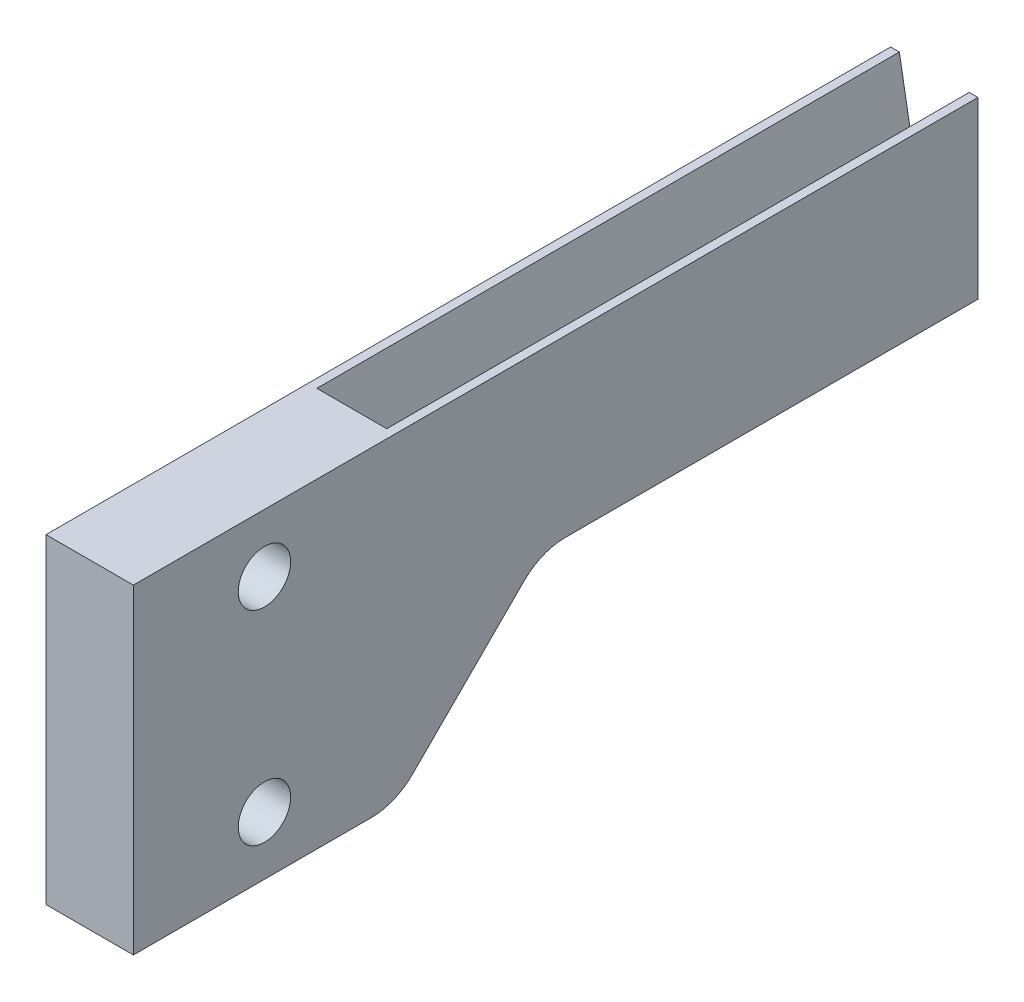
ISO-10303-21;
HEADER;
FILE_DESCRIPTION(('STEP AP214'),'2;1');
FILE_NAME('part.step','',(''),(''),'','','');
FILE_SCHEMA(('AUTOMOTIVE_DESIGN { 1 0 10303 214 1 1 1 1 }'));
ENDSEC;
DATA;
#1=APPLICATION_CONTEXT('core data for automotive mechanical design processes');
#2=APPLICATION_PROTOCOL_DEFINITION('international standard','automotive_design',2000,#1);
#3=PRODUCT_CONTEXT('',#1,'mechanical');
#4=PRODUCT('Part','Part','',(#3));
#5=PRODUCT_RELATED_PRODUCT_CATEGORY('part','',(#4));
#6=PRODUCT_DEFINITION_FORMATION('','',#4);
#7=PRODUCT_DEFINITION_CONTEXT('part definition',#1,'design');
#8=PRODUCT_DEFINITION('design','',#6,#7);
#9=PRODUCT_DEFINITION_SHAPE('','',#8);
#10=(LENGTH_UNIT() NAMED_UNIT(*) SI_UNIT(.MILLI.,.METRE.));
#11=(NAMED_UNIT(*) PLANE_ANGLE_UNIT() SI_UNIT($,.RADIAN.));
#12=(NAMED_UNIT(*) SI_UNIT($,.STERADIAN.) SOLID_ANGLE_UNIT());
#13=UNCERTAINTY_MEASURE_WITH_UNIT(LENGTH_MEASURE(1.E-05),#10,'distance_accuracy_value','');
#14=(GEOMETRIC_REPRESENTATION_CONTEXT(3) GLOBAL_UNCERTAINTY_ASSIGNED_CONTEXT((#13)) GLOBAL_UNIT_ASSIGNED_CONTEXT((#10,
#11,#12)) REPRESENTATION_CONTEXT('',''));
#15=CARTESIAN_POINT('',(0.,0.,0.));
#16=DIRECTION('',(0.,0.,1.));
#17=DIRECTION('',(1.,0.,0.));
#18=AXIS2_PLACEMENT_3D('',#15,#16,#17);
#19=CARTESIAN_POINT('',(9.49999999999999,0.,100.));
#20=DIRECTION('',(0.,1.,0.));
#21=DIRECTION('',(0.,0.,1.));
#22=AXIS2_PLACEMENT_3D('',#19,#20,#21);
#23=PLANE('',#22);
#24=DIRECTION('',(0.,0.,-1.));
#25=VECTOR('',#24,1.);
#26=CARTESIAN_POINT('',(9.49999999999999,0.,100.));
#27=LINE('',#26,#25);
#28=CARTESIAN_POINT('',(9.49999999999999,0.,70.8578643762693));
#29=VERTEX_POINT('',#28);
#30=CARTESIAN_POINT('',(9.49999999999999,0.,0.));
#31=VERTEX_POINT('',#30);
#32=EDGE_CURVE('E252',#29,#31,#27,.T.);
#33=ORIENTED_EDGE('',*,*,#32,.F.);
#34=DIRECTION('',(-1.,0.,0.));
#35=VECTOR('',#34,1.);
#36=CARTESIAN_POINT('',(9.49999999999999,0.,70.8578643762693));
#37=LINE('',#36,#35);
#38=CARTESIAN_POINT('',(-5.50000000000001,0.,70.8578643762693));
#39=VERTEX_POINT('',#38);
#40=EDGE_CURVE('E255',#29,#39,#37,.T.);
#41=ORIENTED_EDGE('',*,*,#40,.T.);
#42=DIRECTION('',(0.,0.,-1.));
#43=VECTOR('',#42,1.);
#44=CARTESIAN_POINT('',(-5.50000000000001,0.,100.));
#45=LINE('',#44,#43);
#46=CARTESIAN_POINT('',(-5.50000000000001,0.,0.));
#47=VERTEX_POINT('',#46);
#48=EDGE_CURVE('E201',#39,#47,#45,.T.);
#49=ORIENTED_EDGE('',*,*,#48,.T.);
#50=DIRECTION('',(1.,0.,0.));
#51=VECTOR('',#50,1.);
#52=CARTESIAN_POINT('',(9.49999999999999,0.,0.));
#53=LINE('',#52,#51);
#54=EDGE_CURVE('E178',#47,#31,#53,.T.);
#55=ORIENTED_EDGE('',*,*,#54,.T.);
#56=EDGE_LOOP('',(#33,#41,#49,#55));
#57=FACE_BOUND('',#56,.T.);
#58=ADVANCED_FACE('F39',(#57),#23,.F.);
#59=CARTESIAN_POINT('',(9.49999999999999,30.,100.));
#60=DIRECTION('',(-1.,0.,0.));
#61=DIRECTION('',(0.,-1.,0.));
#62=AXIS2_PLACEMENT_3D('',#59,#60,#61);
#63=PLANE('',#62);
#64=DIRECTION('',(0.,-0.707106781186551,0.707106781186544));
#65=VECTOR('',#64,1.);
#66=CARTESIAN_POINT('',(9.49999999999999,-22.0710678118654,97.0710678118655));
#67=LINE('',#66,#65);
#68=CARTESIAN_POINT('',(9.49999999999999,-2.92893218813456,77.9289321881348));
#69=VERTEX_POINT('',#68);
#70=CARTESIAN_POINT('',(9.49999999999999,-22.0710678118654,97.0710678118655));
#71=VERTEX_POINT('',#70);
#72=EDGE_CURVE('E125',#69,#71,#67,.T.);
#73=ORIENTED_EDGE('',*,*,#72,.F.);
#74=CARTESIAN_POINT('',(9.49999999999999,-10.,70.8578643762693));
#75=DIRECTION('',(-1.,0.,0.));
#76=DIRECTION('',(0.,-1.,0.));
#77=AXIS2_PLACEMENT_3D('',#74,#75,#76);
#78=CIRCLE('',#77,10.);
#79=EDGE_CURVE('E11',#69,#29,#78,.T.);
#80=ORIENTED_EDGE('',*,*,#79,.T.);
#81=ORIENTED_EDGE('',*,*,#32,.T.);
#82=DIRECTION('',(0.,1.,0.));
#83=VECTOR('',#82,1.);
#84=CARTESIAN_POINT('',(9.49999999999999,30.,0.));
#85=LINE('',#84,#83);
#86=CARTESIAN_POINT('',(9.49999999999999,30.,0.));
#87=VERTEX_POINT('',#86);
#88=EDGE_CURVE('E205',#31,#87,#85,.T.);
#89=ORIENTED_EDGE('',*,*,#88,.T.);
#90=DIRECTION('',(0.,0.,-1.));
#91=VECTOR('',#90,1.);
#92=CARTESIAN_POINT('',(9.49999999999999,30.,100.));
#93=LINE('',#92,#91);
#94=CARTESIAN_POINT('',(9.49999999999999,30.,145.));
#95=VERTEX_POINT('',#94);
#96=EDGE_CURVE('E248',#95,#87,#93,.T.);
#97=ORIENTED_EDGE('',*,*,#96,.F.);
#98=DIRECTION('',(0.,1.,0.));
#99=VECTOR('',#98,1.);
#100=CARTESIAN_POINT('',(9.49999999999999,30.,145.));
#101=LINE('',#100,#99);
#102=CARTESIAN_POINT('',(9.49999999999999,-25.,145.));
#103=VERTEX_POINT('',#102);
#104=EDGE_CURVE('E144',#103,#95,#101,.T.);
#105=ORIENTED_EDGE('',*,*,#104,.F.);
#106=DIRECTION('',(0.,0.,1.));
#107=VECTOR('',#106,1.);
#108=CARTESIAN_POINT('',(9.49999999999999,-25.,104.142135623731));
#109=LINE('',#108,#107);
#110=CARTESIAN_POINT('',(9.49999999999999,-25.,104.142135623731));
#111=VERTEX_POINT('',#110);
#112=EDGE_CURVE('E151',#111,#103,#109,.T.);
#113=ORIENTED_EDGE('',*,*,#112,.F.);
#114=CARTESIAN_POINT('',(9.49999999999999,-15.,104.142135623731));
#115=DIRECTION('',(-1.,0.,0.));
#116=DIRECTION('',(0.,0.,-1.));
#117=AXIS2_PLACEMENT_3D('',#114,#115,#116);
#118=CIRCLE('',#117,10.);
#119=EDGE_CURVE('E134',#71,#111,#118,.T.);
#120=ORIENTED_EDGE('',*,*,#119,.F.);
#121=EDGE_LOOP('',(#73,#80,#81,#89,#97,#105,#113,#120));
#122=FACE_BOUND('',#121,.T.);
#123=CARTESIAN_POINT('',(9.49999999999999,-15.,122.5));
#124=DIRECTION('',(-1.,0.,0.));
#125=DIRECTION('',(0.,0.,1.));
#126=AXIS2_PLACEMENT_3D('',#123,#124,#125);
#127=CIRCLE('',#126,4.49999999999999);
#128=CARTESIAN_POINT('',(9.49999999999999,-15.,127.));
#129=VERTEX_POINT('',#128);
#130=EDGE_CURVE('E340',#129,#129,#127,.T.);
#131=ORIENTED_EDGE('',*,*,#130,.T.);
#132=EDGE_LOOP('',(#131));
#133=FACE_BOUND('',#132,.T.);
#134=CARTESIAN_POINT('',(9.49999999999999,20.,122.5));
#135=DIRECTION('',(-1.,0.,0.));
#136=DIRECTION('',(0.,0.,1.));
#137=AXIS2_PLACEMENT_3D('',#134,#135,#136);
#138=CIRCLE('',#137,4.49999999999998);
#139=CARTESIAN_POINT('',(9.49999999999999,20.,127.));
#140=VERTEX_POINT('',#139);
#141=EDGE_CURVE('E164',#140,#140,#138,.T.);
#142=ORIENTED_EDGE('',*,*,#141,.T.);
#143=EDGE_LOOP('',(#142));
#144=FACE_BOUND('',#143,.T.);
#145=ADVANCED_FACE('F147',(#122,#133,#144),#63,.F.);
#146=CARTESIAN_POINT('',(4.,7.31487272152867,100.));
#147=DIRECTION('',(0.984807753012209,-0.173648177666926,0.));
#148=DIRECTION('',(0.173648177666926,0.984807753012209,0.));
#149=AXIS2_PLACEMENT_3D('',#146,#147,#148);
#150=PLANE('',#149);
#151=DIRECTION('',(-0.173648177666926,-0.984807753012209,0.));
#152=VECTOR('',#151,1.);
#153=CARTESIAN_POINT('',(4.,7.31487272152867,0.));
#154=LINE('',#153,#152);
#155=CARTESIAN_POINT('',(7.99999999999999,30.,0.));
#156=VERTEX_POINT('',#155);
#157=CARTESIAN_POINT('',(4.,7.31487272152867,0.));
#158=VERTEX_POINT('',#157);
#159=EDGE_CURVE('E211',#156,#158,#154,.T.);
#160=ORIENTED_EDGE('',*,*,#159,.T.);
#161=DIRECTION('',(0.,0.,-1.));
#162=VECTOR('',#161,1.);
#163=CARTESIAN_POINT('',(4.,7.31487272152867,100.));
#164=LINE('',#163,#162);
#165=CARTESIAN_POINT('',(4.,7.31487272152867,100.));
#166=VERTEX_POINT('',#165);
#167=EDGE_CURVE('E240',#166,#158,#164,.T.);
#168=ORIENTED_EDGE('',*,*,#167,.F.);
#169=DIRECTION('',(-0.173648177666926,-0.984807753012209,0.));
#170=VECTOR('',#169,1.);
#171=CARTESIAN_POINT('',(4.,7.31487272152867,100.));
#172=LINE('',#171,#170);
#173=CARTESIAN_POINT('',(7.99999999999999,30.,100.));
#174=VERTEX_POINT('',#173);
#175=EDGE_CURVE('E188',#174,#166,#172,.T.);
#176=ORIENTED_EDGE('',*,*,#175,.F.);
#177=DIRECTION('',(0.,0.,-1.));
#178=VECTOR('',#177,1.);
#179=CARTESIAN_POINT('',(7.99999999999999,30.,100.));
#180=LINE('',#179,#178);
#181=EDGE_CURVE('E244',#174,#156,#180,.T.);
#182=ORIENTED_EDGE('',*,*,#181,.T.);
#183=EDGE_LOOP('',(#160,#168,#176,#182));
#184=FACE_BOUND('',#183,.T.);
#185=ADVANCED_FACE('F296',(#184),#150,.F.);
#186=CARTESIAN_POINT('',(0.,7.31487272152867,100.));
#187=DIRECTION('',(0.,-1.,0.));
#188=DIRECTION('',(0.,0.,-1.));
#189=AXIS2_PLACEMENT_3D('',#186,#187,#188);
#190=PLANE('',#189);
#191=DIRECTION('',(-1.,0.,0.));
#192=VECTOR('',#191,1.);
#193=CARTESIAN_POINT('',(0.,7.31487272152867,0.));
#194=LINE('',#193,#192);
#195=CARTESIAN_POINT('',(0.,7.31487272152867,0.));
#196=VERTEX_POINT('',#195);
#197=EDGE_CURVE('E214',#158,#196,#194,.T.);
#198=ORIENTED_EDGE('',*,*,#197,.T.);
#199=DIRECTION('',(0.,0.,-1.));
#200=VECTOR('',#199,1.);
#201=CARTESIAN_POINT('',(0.,7.31487272152867,100.));
#202=LINE('',#201,#200);
#203=CARTESIAN_POINT('',(0.,7.31487272152867,100.));
#204=VERTEX_POINT('',#203);
#205=EDGE_CURVE('E236',#204,#196,#202,.T.);
#206=ORIENTED_EDGE('',*,*,#205,.F.);
#207=DIRECTION('',(-1.,0.,0.));
#208=VECTOR('',#207,1.);
#209=CARTESIAN_POINT('',(0.,7.31487272152867,100.));
#210=LINE('',#209,#208);
#211=EDGE_CURVE('E192',#166,#204,#210,.T.);
#212=ORIENTED_EDGE('',*,*,#211,.F.);
#213=ORIENTED_EDGE('',*,*,#167,.T.);
#214=EDGE_LOOP('',(#198,#206,#212,#213));
#215=FACE_BOUND('',#214,.T.);
#216=ADVANCED_FACE('F301',(#215),#190,.F.);
#217=CARTESIAN_POINT('',(-4.00000000000001,30.,100.));
#218=DIRECTION('',(-0.984807753012209,-0.173648177666927,0.));
#219=DIRECTION('',(0.173648177666927,-0.984807753012209,0.));
#220=AXIS2_PLACEMENT_3D('',#217,#218,#219);
#221=PLANE('',#220);
#222=DIRECTION('',(-0.173648177666927,0.984807753012209,0.));
#223=VECTOR('',#222,1.);
#224=CARTESIAN_POINT('',(-4.00000000000001,30.,0.));
#225=LINE('',#224,#223);
#226=CARTESIAN_POINT('',(-4.00000000000001,30.,0.));
#227=VERTEX_POINT('',#226);
#228=EDGE_CURVE('E217',#196,#227,#225,.T.);
#229=ORIENTED_EDGE('',*,*,#228,.T.);
#230=DIRECTION('',(0.,0.,-1.));
#231=VECTOR('',#230,1.);
#232=CARTESIAN_POINT('',(-4.00000000000001,30.,100.));
#233=LINE('',#232,#231);
#234=CARTESIAN_POINT('',(-4.00000000000001,30.,100.));
#235=VERTEX_POINT('',#234);
#236=EDGE_CURVE('E232',#235,#227,#233,.T.);
#237=ORIENTED_EDGE('',*,*,#236,.F.);
#238=DIRECTION('',(-0.173648177666927,0.984807753012209,0.));
#239=VECTOR('',#238,1.);
#240=CARTESIAN_POINT('',(-4.00000000000001,30.,100.));
#241=LINE('',#240,#239);
#242=EDGE_CURVE('E197',#204,#235,#241,.T.);
#243=ORIENTED_EDGE('',*,*,#242,.F.);
#244=ORIENTED_EDGE('',*,*,#205,.T.);
#245=EDGE_LOOP('',(#229,#237,#243,#244));
#246=FACE_BOUND('',#245,.T.);
#247=ADVANCED_FACE('F305',(#246),#221,.F.);
#248=CARTESIAN_POINT('',(-5.50000000000001,30.,100.));
#249=DIRECTION('',(0.,-1.,0.));
#250=DIRECTION('',(0.,0.,-1.));
#251=AXIS2_PLACEMENT_3D('',#248,#249,#250);
#252=PLANE('',#251);
#253=DIRECTION('',(-1.,0.,0.));
#254=VECTOR('',#253,1.);
#255=CARTESIAN_POINT('',(-5.50000000000001,30.,0.));
#256=LINE('',#255,#254);
#257=CARTESIAN_POINT('',(-5.50000000000001,30.,0.));
#258=VERTEX_POINT('',#257);
#259=EDGE_CURVE('E220',#227,#258,#256,.T.);
#260=ORIENTED_EDGE('',*,*,#259,.T.);
#261=DIRECTION('',(0.,0.,-1.));
#262=VECTOR('',#261,1.);
#263=CARTESIAN_POINT('',(-5.50000000000001,30.,100.));
#264=LINE('',#263,#262);
#265=CARTESIAN_POINT('',(-5.50000000000001,30.,145.));
#266=VERTEX_POINT('',#265);
#267=EDGE_CURVE('E228',#266,#258,#264,.T.);
#268=ORIENTED_EDGE('',*,*,#267,.F.);
#269=DIRECTION('',(-1.,0.,0.));
#270=VECTOR('',#269,1.);
#271=CARTESIAN_POINT('',(9.49999999999999,30.,145.));
#272=LINE('',#271,#270);
#273=EDGE_CURVE('E179',#95,#266,#272,.T.);
#274=ORIENTED_EDGE('',*,*,#273,.F.);
#275=ORIENTED_EDGE('',*,*,#96,.T.);
#276=DIRECTION('',(-1.,0.,0.));
#277=VECTOR('',#276,1.);
#278=CARTESIAN_POINT('',(7.99999999999999,30.,0.));
#279=LINE('',#278,#277);
#280=EDGE_CURVE('E208',#87,#156,#279,.T.);
#281=ORIENTED_EDGE('',*,*,#280,.T.);
#282=ORIENTED_EDGE('',*,*,#181,.F.);
#283=DIRECTION('',(-1.,0.,0.));
#284=VECTOR('',#283,1.);
#285=CARTESIAN_POINT('',(9.49999999999999,30.,100.));
#286=LINE('',#285,#284);
#287=EDGE_CURVE('E174',#174,#235,#286,.T.);
#288=ORIENTED_EDGE('',*,*,#287,.T.);
#289=ORIENTED_EDGE('',*,*,#236,.T.);
#290=EDGE_LOOP('',(#260,#268,#274,#275,#281,#282,#288,#289));
#291=FACE_BOUND('',#290,.T.);
#292=ADVANCED_FACE('F277',(#291),#252,.F.);
#293=CARTESIAN_POINT('',(-5.50000000000001,0.,100.));
#294=DIRECTION('',(1.,0.,0.));
#295=DIRECTION('',(0.,1.,0.));
#296=AXIS2_PLACEMENT_3D('',#293,#294,#295);
#297=PLANE('',#296);
#298=ORIENTED_EDGE('',*,*,#48,.F.);
#299=CARTESIAN_POINT('',(-5.50000000000001,-10.,70.8578643762693));
#300=DIRECTION('',(1.,0.,0.));
#301=DIRECTION('',(0.,1.,0.));
#302=AXIS2_PLACEMENT_3D('',#299,#300,#301);
#303=CIRCLE('',#302,10.);
#304=CARTESIAN_POINT('',(-5.50000000000001,-2.92893218813456,77.9289321881348));
#305=VERTEX_POINT('',#304);
#306=EDGE_CURVE('E48',#39,#305,#303,.T.);
#307=ORIENTED_EDGE('',*,*,#306,.T.);
#308=DIRECTION('',(0.,-0.707106781186551,0.707106781186544));
#309=VECTOR('',#308,1.);
#310=CARTESIAN_POINT('',(-5.50000000000001,-22.0710678118654,97.0710678118655));
#311=LINE('',#310,#309);
#312=CARTESIAN_POINT('',(-5.50000000000001,-22.0710678118654,97.0710678118655));
#313=VERTEX_POINT('',#312);
#314=EDGE_CURVE('E161',#305,#313,#311,.T.);
#315=ORIENTED_EDGE('',*,*,#314,.T.);
#316=CARTESIAN_POINT('',(-5.50000000000001,-15.,104.142135623731));
#317=DIRECTION('',(-1.,0.,0.));
#318=DIRECTION('',(0.,0.,-1.));
#319=AXIS2_PLACEMENT_3D('',#316,#317,#318);
#320=CIRCLE('',#319,10.);
#321=CARTESIAN_POINT('',(-5.50000000000001,-25.,104.142135623731));
#322=VERTEX_POINT('',#321);
#323=EDGE_CURVE('E141',#313,#322,#320,.T.);
#324=ORIENTED_EDGE('',*,*,#323,.T.);
#325=DIRECTION('',(0.,0.,1.));
#326=VECTOR('',#325,1.);
#327=CARTESIAN_POINT('',(-5.50000000000001,-25.,104.142135623731));
#328=LINE('',#327,#326);
#329=CARTESIAN_POINT('',(-5.50000000000001,-25.,145.));
#330=VERTEX_POINT('',#329);
#331=EDGE_CURVE('E167',#322,#330,#328,.T.);
#332=ORIENTED_EDGE('',*,*,#331,.T.);
#333=DIRECTION('',(0.,1.,0.));
#334=VECTOR('',#333,1.);
#335=CARTESIAN_POINT('',(-5.50000000000001,30.,145.));
#336=LINE('',#335,#334);
#337=EDGE_CURVE('E135',#330,#266,#336,.T.);
#338=ORIENTED_EDGE('',*,*,#337,.T.);
#339=ORIENTED_EDGE('',*,*,#267,.T.);
#340=DIRECTION('',(0.,-1.,0.));
#341=VECTOR('',#340,1.);
#342=CARTESIAN_POINT('',(-5.50000000000001,0.,0.));
#343=LINE('',#342,#341);
#344=EDGE_CURVE('E193',#258,#47,#343,.T.);
#345=ORIENTED_EDGE('',*,*,#344,.T.);
#346=EDGE_LOOP('',(#298,#307,#315,#324,#332,#338,#339,#345));
#347=FACE_BOUND('',#346,.T.);
#348=CARTESIAN_POINT('',(-5.50000000000001,-15.,122.5));
#349=DIRECTION('',(-1.,0.,0.));
#350=DIRECTION('',(0.,0.,1.));
#351=AXIS2_PLACEMENT_3D('',#348,#349,#350);
#352=CIRCLE('',#351,4.49999999999999);
#353=CARTESIAN_POINT('',(-5.50000000000001,-15.,127.));
#354=VERTEX_POINT('',#353);
#355=EDGE_CURVE('E345',#354,#354,#352,.T.);
#356=ORIENTED_EDGE('',*,*,#355,.F.);
#357=EDGE_LOOP('',(#356));
#358=FACE_BOUND('',#357,.T.);
#359=CARTESIAN_POINT('',(-5.50000000000001,20.,122.5));
#360=DIRECTION('',(-1.,0.,0.));
#361=DIRECTION('',(0.,0.,1.));
#362=AXIS2_PLACEMENT_3D('',#359,#360,#361);
#363=CIRCLE('',#362,4.49999999999998);
#364=CARTESIAN_POINT('',(-5.50000000000001,20.,127.));
#365=VERTEX_POINT('',#364);
#366=EDGE_CURVE('E337',#365,#365,#363,.T.);
#367=ORIENTED_EDGE('',*,*,#366,.F.);
#368=EDGE_LOOP('',(#367));
#369=FACE_BOUND('',#368,.T.);
#370=ADVANCED_FACE('F265',(#347,#358,#369),#297,.F.);
#371=CARTESIAN_POINT('',(0.,0.,0.));
#372=DIRECTION('',(0.,0.,-1.));
#373=DIRECTION('',(-1.,0.,0.));
#374=AXIS2_PLACEMENT_3D('',#371,#372,#373);
#375=PLANE('',#374);
#376=ORIENTED_EDGE('',*,*,#54,.F.);
#377=ORIENTED_EDGE('',*,*,#344,.F.);
#378=ORIENTED_EDGE('',*,*,#259,.F.);
#379=ORIENTED_EDGE('',*,*,#228,.F.);
#380=ORIENTED_EDGE('',*,*,#197,.F.);
#381=ORIENTED_EDGE('',*,*,#159,.F.);
#382=ORIENTED_EDGE('',*,*,#280,.F.);
#383=ORIENTED_EDGE('',*,*,#88,.F.);
#384=EDGE_LOOP('',(#376,#377,#378,#379,#380,#381,#382,#383));
#385=FACE_BOUND('',#384,.T.);
#386=ADVANCED_FACE('F272',(#385),#375,.T.);
#387=CARTESIAN_POINT('',(9.49999999999999,30.,100.));
#388=DIRECTION('',(0.,0.,-1.));
#389=DIRECTION('',(-1.,0.,0.));
#390=AXIS2_PLACEMENT_3D('',#387,#388,#389);
#391=PLANE('',#390);
#392=ORIENTED_EDGE('',*,*,#175,.T.);
#393=ORIENTED_EDGE('',*,*,#211,.T.);
#394=ORIENTED_EDGE('',*,*,#242,.T.);
#395=ORIENTED_EDGE('',*,*,#287,.F.);
#396=EDGE_LOOP('',(#392,#393,#394,#395));
#397=FACE_BOUND('',#396,.T.);
#398=ADVANCED_FACE('F316',(#397),#391,.T.);
#399=CARTESIAN_POINT('',(9.49999999999999,30.,145.));
#400=DIRECTION('',(0.,0.,1.));
#401=DIRECTION('',(1.,0.,0.));
#402=AXIS2_PLACEMENT_3D('',#399,#400,#401);
#403=PLANE('',#402);
#404=ORIENTED_EDGE('',*,*,#337,.F.);
#405=DIRECTION('',(-1.,0.,0.));
#406=VECTOR('',#405,1.);
#407=CARTESIAN_POINT('',(9.49999999999999,-25.,145.));
#408=LINE('',#407,#406);
#409=EDGE_CURVE('E183',#103,#330,#408,.T.);
#410=ORIENTED_EDGE('',*,*,#409,.F.);
#411=ORIENTED_EDGE('',*,*,#104,.T.);
#412=ORIENTED_EDGE('',*,*,#273,.T.);
#413=EDGE_LOOP('',(#404,#410,#411,#412));
#414=FACE_BOUND('',#413,.T.);
#415=ADVANCED_FACE('F280',(#414),#403,.T.);
#416=CARTESIAN_POINT('',(9.49999999999999,-25.,104.142135623731));
#417=DIRECTION('',(0.,-1.,0.));
#418=DIRECTION('',(0.,0.,-1.));
#419=AXIS2_PLACEMENT_3D('',#416,#417,#418);
#420=PLANE('',#419);
#421=ORIENTED_EDGE('',*,*,#331,.F.);
#422=DIRECTION('',(-1.,0.,0.));
#423=VECTOR('',#422,1.);
#424=CARTESIAN_POINT('',(9.49999999999999,-25.,104.142135623731));
#425=LINE('',#424,#423);
#426=EDGE_CURVE('E143',#111,#322,#425,.T.);
#427=ORIENTED_EDGE('',*,*,#426,.F.);
#428=ORIENTED_EDGE('',*,*,#112,.T.);
#429=ORIENTED_EDGE('',*,*,#409,.T.);
#430=EDGE_LOOP('',(#421,#427,#428,#429));
#431=FACE_BOUND('',#430,.T.);
#432=ADVANCED_FACE('F283',(#431),#420,.T.);
#433=CARTESIAN_POINT('',(9.49999999999999,-15.,104.142135623731));
#434=DIRECTION('',(-1.,0.,0.));
#435=DIRECTION('',(0.,0.,1.));
#436=AXIS2_PLACEMENT_3D('',#433,#434,#435);
#437=CYLINDRICAL_SURFACE('',#436,10.);
#438=ORIENTED_EDGE('',*,*,#323,.F.);
#439=DIRECTION('',(-1.,0.,0.));
#440=VECTOR('',#439,1.);
#441=CARTESIAN_POINT('',(9.49999999999999,-22.0710678118654,97.0710678118655));
#442=LINE('',#441,#440);
#443=EDGE_CURVE('E128',#71,#313,#442,.T.);
#444=ORIENTED_EDGE('',*,*,#443,.F.);
#445=ORIENTED_EDGE('',*,*,#119,.T.);
#446=ORIENTED_EDGE('',*,*,#426,.T.);
#447=EDGE_LOOP('',(#438,#444,#445,#446));
#448=FACE_BOUND('',#447,.T.);
#449=ADVANCED_FACE('F139',(#448),#437,.T.);
#450=CARTESIAN_POINT('',(9.49999999999999,-22.0710678118654,97.0710678118655));
#451=DIRECTION('',(0.,-0.707106781186544,-0.707106781186551));
#452=DIRECTION('',(0.,0.707106781186551,-0.707106781186544));
#453=AXIS2_PLACEMENT_3D('',#450,#451,#452);
#454=PLANE('',#453);
#455=ORIENTED_EDGE('',*,*,#314,.F.);
#456=DIRECTION('',(-1.,0.,0.));
#457=VECTOR('',#456,1.);
#458=CARTESIAN_POINT('',(9.49999999999999,-2.92893218813456,77.9289321881348));
#459=LINE('',#458,#457);
#460=EDGE_CURVE('E55',#305,#69,#459,.F.);
#461=ORIENTED_EDGE('',*,*,#460,.T.);
#462=ORIENTED_EDGE('',*,*,#72,.T.);
#463=ORIENTED_EDGE('',*,*,#443,.T.);
#464=EDGE_LOOP('',(#455,#461,#462,#463));
#465=FACE_BOUND('',#464,.T.);
#466=ADVANCED_FACE('F127',(#465),#454,.T.);
#467=CARTESIAN_POINT('',(9.49999999999999,20.,122.5));
#468=DIRECTION('',(-1.,0.,0.));
#469=DIRECTION('',(0.,0.,1.));
#470=AXIS2_PLACEMENT_3D('',#467,#468,#469);
#471=CYLINDRICAL_SURFACE('',#470,4.49999999999998);
#472=ORIENTED_EDGE('',*,*,#141,.F.);
#473=EDGE_LOOP('',(#472));
#474=FACE_BOUND('',#473,.T.);
#475=ORIENTED_EDGE('',*,*,#366,.T.);
#476=EDGE_LOOP('',(#475));
#477=FACE_BOUND('',#476,.T.);
#478=ADVANCED_FACE('F289',(#474,#477),#471,.F.);
#479=CARTESIAN_POINT('',(9.49999999999999,-15.,122.5));
#480=DIRECTION('',(-1.,0.,0.));
#481=DIRECTION('',(0.,0.,1.));
#482=AXIS2_PLACEMENT_3D('',#479,#480,#481);
#483=CYLINDRICAL_SURFACE('',#482,4.49999999999999);
#484=ORIENTED_EDGE('',*,*,#130,.F.);
#485=EDGE_LOOP('',(#484));
#486=FACE_BOUND('',#485,.T.);
#487=ORIENTED_EDGE('',*,*,#355,.T.);
#488=EDGE_LOOP('',(#487));
#489=FACE_BOUND('',#488,.T.);
#490=ADVANCED_FACE('F285',(#486,#489),#483,.F.);
#491=CARTESIAN_POINT('',(9.49999999999999,-10.,70.8578643762693));
#492=DIRECTION('',(-1.,0.,0.));
#493=DIRECTION('',(0.,0.,1.));
#494=AXIS2_PLACEMENT_3D('',#491,#492,#493);
#495=CYLINDRICAL_SURFACE('',#494,10.);
#496=ORIENTED_EDGE('',*,*,#79,.F.);
#497=ORIENTED_EDGE('',*,*,#460,.F.);
#498=ORIENTED_EDGE('',*,*,#306,.F.);
#499=ORIENTED_EDGE('',*,*,#40,.F.);
#500=EDGE_LOOP('',(#496,#497,#498,#499));
#501=FACE_BOUND('',#500,.T.);
#502=ADVANCED_FACE('F41',(#501),#495,.F.);
#503=CLOSED_SHELL('',(#58,#145,#185,#216,#247,#292,#370,#386,#398,#415,#432,#449,#466,#478,#490,#502));
#504=MANIFOLD_SOLID_BREP('B2',#503);
#505=ADVANCED_BREP_SHAPE_REPRESENTATION('',(#18,#504),#14);
#506=SHAPE_DEFINITION_REPRESENTATION(#9,#505);
ENDSEC;
END-ISO-10303-21;
